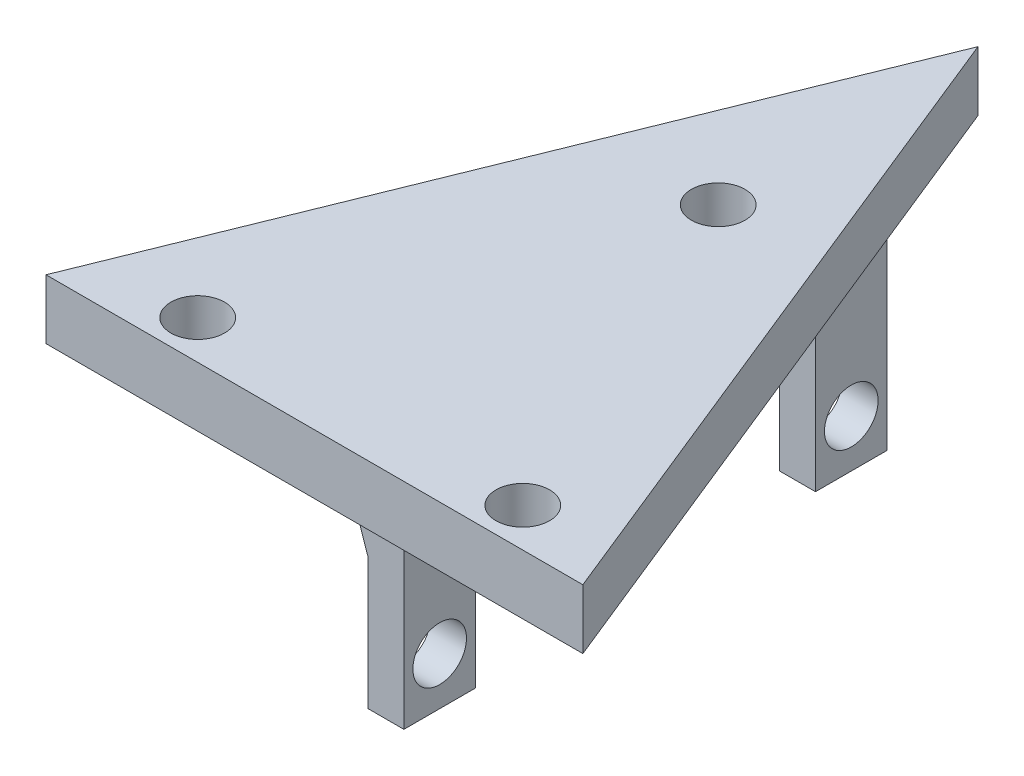
ISO-10303-21;
HEADER;
FILE_DESCRIPTION(('STEP AP214'),'2;1');
FILE_NAME('part.step','',(''),(''),'','','');
FILE_SCHEMA(('AUTOMOTIVE_DESIGN { 1 0 10303 214 1 1 1 1 }'));
ENDSEC;
DATA;
#1=APPLICATION_CONTEXT('core data for automotive mechanical design processes');
#2=APPLICATION_PROTOCOL_DEFINITION('international standard','automotive_design',2000,#1);
#3=PRODUCT_CONTEXT('',#1,'mechanical');
#4=PRODUCT('Part','Part','',(#3));
#5=PRODUCT_RELATED_PRODUCT_CATEGORY('part','',(#4));
#6=PRODUCT_DEFINITION_FORMATION('','',#4);
#7=PRODUCT_DEFINITION_CONTEXT('part definition',#1,'design');
#8=PRODUCT_DEFINITION('design','',#6,#7);
#9=PRODUCT_DEFINITION_SHAPE('','',#8);
#10=(LENGTH_UNIT() NAMED_UNIT(*) SI_UNIT(.MILLI.,.METRE.));
#11=(NAMED_UNIT(*) PLANE_ANGLE_UNIT() SI_UNIT($,.RADIAN.));
#12=(NAMED_UNIT(*) SI_UNIT($,.STERADIAN.) SOLID_ANGLE_UNIT());
#13=UNCERTAINTY_MEASURE_WITH_UNIT(LENGTH_MEASURE(1.E-05),#10,'distance_accuracy_value','');
#14=(GEOMETRIC_REPRESENTATION_CONTEXT(3) GLOBAL_UNCERTAINTY_ASSIGNED_CONTEXT((#13)) GLOBAL_UNIT_ASSIGNED_CONTEXT((#10,
#11,#12)) REPRESENTATION_CONTEXT('',''));
#15=CARTESIAN_POINT('',(0.,0.,0.));
#16=DIRECTION('',(0.,0.,1.));
#17=DIRECTION('',(1.,0.,0.));
#18=AXIS2_PLACEMENT_3D('',#15,#16,#17);
#19=CARTESIAN_POINT('',(0.,0.,0.));
#20=DIRECTION('',(0.,1.,0.));
#21=DIRECTION('',(0.,0.,1.));
#22=AXIS2_PLACEMENT_3D('',#19,#20,#21);
#23=PLANE('',#22);
#24=DIRECTION('',(0.,0.,1.));
#25=VECTOR('',#24,1.);
#26=CARTESIAN_POINT('',(10.6610233893439,0.,-11.));
#27=LINE('',#26,#25);
#28=CARTESIAN_POINT('',(10.6610233893439,0.,-11.));
#29=VERTEX_POINT('',#28);
#30=CARTESIAN_POINT('',(10.6610233893439,0.,-5.));
#31=VERTEX_POINT('',#30);
#32=EDGE_CURVE('E351',#29,#31,#27,.T.);
#33=ORIENTED_EDGE('',*,*,#32,.F.);
#34=DIRECTION('',(1.,0.,0.));
#35=VECTOR('',#34,1.);
#36=CARTESIAN_POINT('',(7.66102338934391,0.,-11.));
#37=LINE('',#36,#35);
#38=CARTESIAN_POINT('',(5.25483661086357,0.,-11.));
#39=VERTEX_POINT('',#38);
#40=EDGE_CURVE('E47',#39,#29,#37,.T.);
#41=ORIENTED_EDGE('',*,*,#40,.F.);
#42=DIRECTION('',(0.,0.,1.));
#43=VECTOR('',#42,1.);
#44=CARTESIAN_POINT('',(5.25483661086357,0.,0.));
#45=LINE('',#44,#43);
#46=CARTESIAN_POINT('',(5.25483661086357,0.,-5.));
#47=VERTEX_POINT('',#46);
#48=EDGE_CURVE('E334',#39,#47,#45,.T.);
#49=ORIENTED_EDGE('',*,*,#48,.T.);
#50=DIRECTION('',(-1.,0.,0.));
#51=VECTOR('',#50,1.);
#52=CARTESIAN_POINT('',(7.66102338934391,0.,-5.));
#53=LINE('',#52,#51);
#54=EDGE_CURVE('E55',#31,#47,#53,.T.);
#55=ORIENTED_EDGE('',*,*,#54,.F.);
#56=EDGE_LOOP('',(#33,#41,#49,#55));
#57=FACE_BOUND('',#56,.T.);
#58=CARTESIAN_POINT('',(22.3778038791205,0.,-3.25));
#59=DIRECTION('',(0.,-1.,0.));
#60=DIRECTION('',(0.,0.,-1.));
#61=AXIS2_PLACEMENT_3D('',#58,#59,#60);
#62=CIRCLE('',#61,2.24789999999999);
#63=CARTESIAN_POINT('',(22.3778038791205,0.,-5.49789999999999));
#64=VERTEX_POINT('',#63);
#65=EDGE_CURVE('E183',#64,#64,#62,.T.);
#66=ORIENTED_EDGE('',*,*,#65,.F.);
#67=EDGE_LOOP('',(#66));
#68=FACE_BOUND('',#67,.T.);
#69=DIRECTION('',(0.,0.,1.));
#70=VECTOR('',#69,1.);
#71=CARTESIAN_POINT('',(10.6610233893439,0.,-45.5));
#72=LINE('',#71,#70);
#73=CARTESIAN_POINT('',(10.6610233893439,0.,-45.5));
#74=VERTEX_POINT('',#73);
#75=CARTESIAN_POINT('',(10.6610233893439,0.,-39.5));
#76=VERTEX_POINT('',#75);
#77=EDGE_CURVE('E155',#74,#76,#72,.T.);
#78=ORIENTED_EDGE('',*,*,#77,.F.);
#79=DIRECTION('',(1.,0.,0.));
#80=VECTOR('',#79,1.);
#81=CARTESIAN_POINT('',(7.66102338934392,0.,-45.5));
#82=LINE('',#81,#80);
#83=CARTESIAN_POINT('',(5.16102338934392,0.,-45.5));
#84=VERTEX_POINT('',#83);
#85=EDGE_CURVE('E152',#84,#74,#82,.T.);
#86=ORIENTED_EDGE('',*,*,#85,.F.);
#87=DIRECTION('',(0.,0.,1.));
#88=VECTOR('',#87,1.);
#89=CARTESIAN_POINT('',(5.16102338934392,0.,0.));
#90=LINE('',#89,#88);
#91=CARTESIAN_POINT('',(5.16102338934392,0.,-39.5));
#92=VERTEX_POINT('',#91);
#93=EDGE_CURVE('E344',#84,#92,#90,.T.);
#94=ORIENTED_EDGE('',*,*,#93,.T.);
#95=DIRECTION('',(-1.,0.,0.));
#96=VECTOR('',#95,1.);
#97=CARTESIAN_POINT('',(7.66102338934392,0.,-39.5));
#98=LINE('',#97,#96);
#99=EDGE_CURVE('E165',#76,#92,#98,.T.);
#100=ORIENTED_EDGE('',*,*,#99,.F.);
#101=EDGE_LOOP('',(#78,#86,#94,#100));
#102=FACE_BOUND('',#101,.T.);
#103=CARTESIAN_POINT('',(-4.87219612087947,0.,-3.25));
#104=DIRECTION('',(0.,-1.,0.));
#105=DIRECTION('',(0.,0.,-1.));
#106=AXIS2_PLACEMENT_3D('',#103,#104,#105);
#107=CIRCLE('',#106,2.24789999999999);
#108=CARTESIAN_POINT('',(-4.87219612087947,0.,-5.49789999999999));
#109=VERTEX_POINT('',#108);
#110=EDGE_CURVE('E189',#109,#109,#107,.T.);
#111=ORIENTED_EDGE('',*,*,#110,.F.);
#112=EDGE_LOOP('',(#111));
#113=FACE_BOUND('',#112,.T.);
#114=CARTESIAN_POINT('',(8.75280387912053,0.,-33.251031232276));
#115=DIRECTION('',(0.,-1.,0.));
#116=DIRECTION('',(0.,0.,-1.));
#117=AXIS2_PLACEMENT_3D('',#114,#115,#116);
#118=CIRCLE('',#117,2.24789999999999);
#119=CARTESIAN_POINT('',(8.75280387912053,0.,-35.498931232276));
#120=VERTEX_POINT('',#119);
#121=EDGE_CURVE('E195',#120,#120,#118,.T.);
#122=ORIENTED_EDGE('',*,*,#121,.F.);
#123=EDGE_LOOP('',(#122));
#124=FACE_BOUND('',#123,.T.);
#125=DIRECTION('',(-0.375,0.,0.927024810886958));
#126=VECTOR('',#125,1.);
#127=CARTESIAN_POINT('',(8.16102338934392,0.,-55.6214886532175));
#128=LINE('',#127,#126);
#129=CARTESIAN_POINT('',(8.16102338934392,0.,-55.6214886532175));
#130=VERTEX_POINT('',#129);
#131=CARTESIAN_POINT('',(-14.3389766106561,0.,0.));
#132=VERTEX_POINT('',#131);
#133=EDGE_CURVE('E201',#130,#132,#128,.T.);
#134=ORIENTED_EDGE('',*,*,#133,.F.);
#135=DIRECTION('',(-0.375,0.,-0.927024810886958));
#136=VECTOR('',#135,1.);
#137=CARTESIAN_POINT('',(30.6610233893439,0.,0.));
#138=LINE('',#137,#136);
#139=CARTESIAN_POINT('',(30.6610233893439,0.,0.));
#140=VERTEX_POINT('',#139);
#141=EDGE_CURVE('E205',#140,#130,#138,.T.);
#142=ORIENTED_EDGE('',*,*,#141,.F.);
#143=DIRECTION('',(1.,0.,0.));
#144=VECTOR('',#143,1.);
#145=CARTESIAN_POINT('',(-14.3389766106561,0.,0.));
#146=LINE('',#145,#144);
#147=EDGE_CURVE('E212',#132,#140,#146,.T.);
#148=ORIENTED_EDGE('',*,*,#147,.F.);
#149=EDGE_LOOP('',(#134,#142,#148));
#150=FACE_BOUND('',#149,.T.);
#151=ADVANCED_FACE('F32',(#57,#68,#102,#113,#124,#150),#23,.F.);
#152=CARTESIAN_POINT('',(8.16102338934392,5.,-55.6214886532175));
#153=DIRECTION('',(0.927024810886958,0.,0.375));
#154=DIRECTION('',(0.375,0.,-0.927024810886958));
#155=AXIS2_PLACEMENT_3D('',#152,#153,#154);
#156=PLANE('',#155);
#157=DIRECTION('',(0.,-1.,0.));
#158=VECTOR('',#157,1.);
#159=CARTESIAN_POINT('',(-14.3389766106561,5.,0.));
#160=LINE('',#159,#158);
#161=CARTESIAN_POINT('',(-14.3389766106561,5.,0.));
#162=VERTEX_POINT('',#161);
#163=EDGE_CURVE('E11',#162,#132,#160,.T.);
#164=ORIENTED_EDGE('',*,*,#163,.F.);
#165=DIRECTION('',(-0.375,0.,0.927024810886958));
#166=VECTOR('',#165,1.);
#167=CARTESIAN_POINT('',(8.16102338934392,5.,-55.6214886532175));
#168=LINE('',#167,#166);
#169=CARTESIAN_POINT('',(8.16102338934392,5.,-55.6214886532175));
#170=VERTEX_POINT('',#169);
#171=EDGE_CURVE('E202',#170,#162,#168,.T.);
#172=ORIENTED_EDGE('',*,*,#171,.F.);
#173=DIRECTION('',(0.,-1.,0.));
#174=VECTOR('',#173,1.);
#175=CARTESIAN_POINT('',(8.16102338934392,5.,-55.6214886532175));
#176=LINE('',#175,#174);
#177=EDGE_CURVE('E209',#170,#130,#176,.T.);
#178=ORIENTED_EDGE('',*,*,#177,.T.);
#179=ORIENTED_EDGE('',*,*,#133,.T.);
#180=EDGE_LOOP('',(#164,#172,#178,#179));
#181=FACE_BOUND('',#180,.T.);
#182=ADVANCED_FACE('F34',(#181),#156,.F.);
#183=CARTESIAN_POINT('',(-14.3389766106561,5.,0.));
#184=DIRECTION('',(0.,0.,-1.));
#185=DIRECTION('',(-1.,0.,0.));
#186=AXIS2_PLACEMENT_3D('',#183,#184,#185);
#187=PLANE('',#186);
#188=ORIENTED_EDGE('',*,*,#147,.T.);
#189=DIRECTION('',(0.,-1.,0.));
#190=VECTOR('',#189,1.);
#191=CARTESIAN_POINT('',(30.6610233893439,5.,0.));
#192=LINE('',#191,#190);
#193=CARTESIAN_POINT('',(30.6610233893439,5.,0.));
#194=VERTEX_POINT('',#193);
#195=EDGE_CURVE('E40',#194,#140,#192,.T.);
#196=ORIENTED_EDGE('',*,*,#195,.F.);
#197=DIRECTION('',(1.,0.,0.));
#198=VECTOR('',#197,1.);
#199=CARTESIAN_POINT('',(-14.3389766106561,5.,0.));
#200=LINE('',#199,#198);
#201=EDGE_CURVE('E204',#162,#194,#200,.T.);
#202=ORIENTED_EDGE('',*,*,#201,.F.);
#203=ORIENTED_EDGE('',*,*,#163,.T.);
#204=EDGE_LOOP('',(#188,#196,#202,#203));
#205=FACE_BOUND('',#204,.T.);
#206=ADVANCED_FACE('F233',(#205),#187,.F.);
#207=CARTESIAN_POINT('',(30.6610233893439,5.,0.));
#208=DIRECTION('',(-0.927024810886958,0.,0.375));
#209=DIRECTION('',(0.375,0.,0.927024810886958));
#210=AXIS2_PLACEMENT_3D('',#207,#208,#209);
#211=PLANE('',#210);
#212=ORIENTED_EDGE('',*,*,#177,.F.);
#213=DIRECTION('',(-0.375,0.,-0.927024810886958));
#214=VECTOR('',#213,1.);
#215=CARTESIAN_POINT('',(30.6610233893439,5.,0.));
#216=LINE('',#215,#214);
#217=EDGE_CURVE('E207',#194,#170,#216,.T.);
#218=ORIENTED_EDGE('',*,*,#217,.F.);
#219=ORIENTED_EDGE('',*,*,#195,.T.);
#220=ORIENTED_EDGE('',*,*,#141,.T.);
#221=EDGE_LOOP('',(#212,#218,#219,#220));
#222=FACE_BOUND('',#221,.T.);
#223=ADVANCED_FACE('F222',(#222),#211,.F.);
#224=CARTESIAN_POINT('',(0.,5.,0.));
#225=DIRECTION('',(0.,1.,0.));
#226=DIRECTION('',(0.,0.,1.));
#227=AXIS2_PLACEMENT_3D('',#224,#225,#226);
#228=PLANE('',#227);
#229=CARTESIAN_POINT('',(22.3778038791205,5.,-3.25));
#230=DIRECTION('',(0.,1.,0.));
#231=DIRECTION('',(0.,0.,1.));
#232=AXIS2_PLACEMENT_3D('',#229,#230,#231);
#233=CIRCLE('',#232,2.24789999999999);
#234=CARTESIAN_POINT('',(22.3778038791205,5.,-1.00210000000001));
#235=VERTEX_POINT('',#234);
#236=EDGE_CURVE('E186',#235,#235,#233,.T.);
#237=ORIENTED_EDGE('',*,*,#236,.F.);
#238=EDGE_LOOP('',(#237));
#239=FACE_BOUND('',#238,.T.);
#240=ORIENTED_EDGE('',*,*,#217,.T.);
#241=ORIENTED_EDGE('',*,*,#171,.T.);
#242=ORIENTED_EDGE('',*,*,#201,.T.);
#243=EDGE_LOOP('',(#240,#241,#242));
#244=FACE_BOUND('',#243,.T.);
#245=CARTESIAN_POINT('',(-4.87219612087947,5.,-3.25));
#246=DIRECTION('',(0.,1.,0.));
#247=DIRECTION('',(0.,0.,1.));
#248=AXIS2_PLACEMENT_3D('',#245,#246,#247);
#249=CIRCLE('',#248,2.24789999999999);
#250=CARTESIAN_POINT('',(-4.87219612087947,5.,-1.00210000000001));
#251=VERTEX_POINT('',#250);
#252=EDGE_CURVE('E192',#251,#251,#249,.T.);
#253=ORIENTED_EDGE('',*,*,#252,.F.);
#254=EDGE_LOOP('',(#253));
#255=FACE_BOUND('',#254,.T.);
#256=CARTESIAN_POINT('',(8.75280387912053,5.,-33.251031232276));
#257=DIRECTION('',(0.,1.,0.));
#258=DIRECTION('',(0.,0.,1.));
#259=AXIS2_PLACEMENT_3D('',#256,#257,#258);
#260=CIRCLE('',#259,2.24789999999999);
#261=CARTESIAN_POINT('',(8.75280387912053,5.,-31.003131232276));
#262=VERTEX_POINT('',#261);
#263=EDGE_CURVE('E198',#262,#262,#260,.T.);
#264=ORIENTED_EDGE('',*,*,#263,.F.);
#265=EDGE_LOOP('',(#264));
#266=FACE_BOUND('',#265,.T.);
#267=ADVANCED_FACE('F231',(#239,#244,#255,#266),#228,.T.);
#268=CARTESIAN_POINT('',(8.75280387912053,0.,-33.251031232276));
#269=DIRECTION('',(0.,-1.,0.));
#270=DIRECTION('',(0.,0.,-1.));
#271=AXIS2_PLACEMENT_3D('',#268,#269,#270);
#272=CYLINDRICAL_SURFACE('',#271,2.24789999999999);
#273=ORIENTED_EDGE('',*,*,#263,.T.);
#274=EDGE_LOOP('',(#273));
#275=FACE_BOUND('',#274,.T.);
#276=ORIENTED_EDGE('',*,*,#121,.T.);
#277=EDGE_LOOP('',(#276));
#278=FACE_BOUND('',#277,.T.);
#279=ADVANCED_FACE('F248',(#275,#278),#272,.F.);
#280=CARTESIAN_POINT('',(-4.87219612087947,0.,-3.25));
#281=DIRECTION('',(0.,-1.,0.));
#282=DIRECTION('',(0.,0.,-1.));
#283=AXIS2_PLACEMENT_3D('',#280,#281,#282);
#284=CYLINDRICAL_SURFACE('',#283,2.24789999999999);
#285=ORIENTED_EDGE('',*,*,#252,.T.);
#286=EDGE_LOOP('',(#285));
#287=FACE_BOUND('',#286,.T.);
#288=ORIENTED_EDGE('',*,*,#110,.T.);
#289=EDGE_LOOP('',(#288));
#290=FACE_BOUND('',#289,.T.);
#291=ADVANCED_FACE('F252',(#287,#290),#284,.F.);
#292=CARTESIAN_POINT('',(22.3778038791205,0.,-3.25));
#293=DIRECTION('',(0.,-1.,0.));
#294=DIRECTION('',(0.,0.,-1.));
#295=AXIS2_PLACEMENT_3D('',#292,#293,#294);
#296=CYLINDRICAL_SURFACE('',#295,2.24789999999999);
#297=ORIENTED_EDGE('',*,*,#236,.T.);
#298=EDGE_LOOP('',(#297));
#299=FACE_BOUND('',#298,.T.);
#300=ORIENTED_EDGE('',*,*,#65,.T.);
#301=EDGE_LOOP('',(#300));
#302=FACE_BOUND('',#301,.T.);
#303=ADVANCED_FACE('F256',(#299,#302),#296,.F.);
#304=CARTESIAN_POINT('',(7.66102338934392,-18.,-45.5));
#305=DIRECTION('',(1.,0.,0.));
#306=DIRECTION('',(0.,0.,-1.));
#307=AXIS2_PLACEMENT_3D('',#304,#305,#306);
#308=PLANE('',#307);
#309=CARTESIAN_POINT('',(7.66102338934393,-14.,-42.5));
#310=DIRECTION('',(-1.,0.,0.));
#311=DIRECTION('',(0.,0.,1.));
#312=AXIS2_PLACEMENT_3D('',#309,#310,#311);
#313=CIRCLE('',#312,2.24789999999999);
#314=CARTESIAN_POINT('',(7.66102338934393,-14.,-40.2521));
#315=VERTEX_POINT('',#314);
#316=EDGE_CURVE('E315',#315,#315,#313,.T.);
#317=ORIENTED_EDGE('',*,*,#316,.F.);
#318=EDGE_LOOP('',(#317));
#319=FACE_BOUND('',#318,.T.);
#320=DIRECTION('',(0.,1.,0.));
#321=VECTOR('',#320,1.);
#322=CARTESIAN_POINT('',(7.66102338934392,-18.,-39.5));
#323=LINE('',#322,#321);
#324=CARTESIAN_POINT('',(7.66102338934392,-18.,-39.5));
#325=VERTEX_POINT('',#324);
#326=CARTESIAN_POINT('',(7.66102338934392,-6.99999999999998,-39.5));
#327=VERTEX_POINT('',#326);
#328=EDGE_CURVE('E170',#325,#327,#323,.T.);
#329=ORIENTED_EDGE('',*,*,#328,.T.);
#330=DIRECTION('',(0.,0.,-1.));
#331=VECTOR('',#330,1.);
#332=CARTESIAN_POINT('',(7.66102338934392,-7.,-45.5));
#333=LINE('',#332,#331);
#334=CARTESIAN_POINT('',(7.66102338934392,-6.99999999999998,-45.5));
#335=VERTEX_POINT('',#334);
#336=EDGE_CURVE('E340',#327,#335,#333,.T.);
#337=ORIENTED_EDGE('',*,*,#336,.T.);
#338=DIRECTION('',(0.,1.,0.));
#339=VECTOR('',#338,1.);
#340=CARTESIAN_POINT('',(7.66102338934392,-18.,-45.5));
#341=LINE('',#340,#339);
#342=CARTESIAN_POINT('',(7.66102338934392,-18.,-45.5));
#343=VERTEX_POINT('',#342);
#344=EDGE_CURVE('E180',#343,#335,#341,.T.);
#345=ORIENTED_EDGE('',*,*,#344,.F.);
#346=DIRECTION('',(0.,0.,-1.));
#347=VECTOR('',#346,1.);
#348=CARTESIAN_POINT('',(7.66102338934392,-18.,-45.5));
#349=LINE('',#348,#347);
#350=EDGE_CURVE('E161',#325,#343,#349,.T.);
#351=ORIENTED_EDGE('',*,*,#350,.F.);
#352=EDGE_LOOP('',(#329,#337,#345,#351));
#353=FACE_BOUND('',#352,.T.);
#354=ADVANCED_FACE('F260',(#319,#353),#308,.F.);
#355=CARTESIAN_POINT('',(7.66102338934392,-18.,-45.5));
#356=DIRECTION('',(0.,0.,1.));
#357=DIRECTION('',(1.,0.,0.));
#358=AXIS2_PLACEMENT_3D('',#355,#356,#357);
#359=PLANE('',#358);
#360=ORIENTED_EDGE('',*,*,#344,.T.);
#361=DIRECTION('',(-0.336336396998156,0.941741911594837,0.));
#362=VECTOR('',#361,1.);
#363=CARTESIAN_POINT('',(7.66102338934392,-7.,-45.5));
#364=LINE('',#363,#362);
#365=EDGE_CURVE('E337',#335,#84,#364,.T.);
#366=ORIENTED_EDGE('',*,*,#365,.T.);
#367=ORIENTED_EDGE('',*,*,#85,.T.);
#368=DIRECTION('',(0.,1.,0.));
#369=VECTOR('',#368,1.);
#370=CARTESIAN_POINT('',(10.6610233893439,-18.,-45.5));
#371=LINE('',#370,#369);
#372=CARTESIAN_POINT('',(10.6610233893439,-18.,-45.5));
#373=VERTEX_POINT('',#372);
#374=EDGE_CURVE('E178',#373,#74,#371,.T.);
#375=ORIENTED_EDGE('',*,*,#374,.F.);
#376=DIRECTION('',(1.,0.,0.));
#377=VECTOR('',#376,1.);
#378=CARTESIAN_POINT('',(7.66102338934392,-18.,-45.5));
#379=LINE('',#378,#377);
#380=EDGE_CURVE('E164',#343,#373,#379,.T.);
#381=ORIENTED_EDGE('',*,*,#380,.F.);
#382=EDGE_LOOP('',(#360,#366,#367,#375,#381));
#383=FACE_BOUND('',#382,.T.);
#384=ADVANCED_FACE('F264',(#383),#359,.F.);
#385=CARTESIAN_POINT('',(10.6610233893439,-18.,-45.5));
#386=DIRECTION('',(-1.,0.,0.));
#387=DIRECTION('',(0.,0.,1.));
#388=AXIS2_PLACEMENT_3D('',#385,#386,#387);
#389=PLANE('',#388);
#390=CARTESIAN_POINT('',(10.6610233893439,-14.,-42.5));
#391=DIRECTION('',(-1.,0.,0.));
#392=DIRECTION('',(0.,0.,1.));
#393=AXIS2_PLACEMENT_3D('',#390,#391,#392);
#394=CIRCLE('',#393,2.24789999999999);
#395=CARTESIAN_POINT('',(10.6610233893439,-14.,-40.2521));
#396=VERTEX_POINT('',#395);
#397=EDGE_CURVE('E318',#396,#396,#394,.T.);
#398=ORIENTED_EDGE('',*,*,#397,.T.);
#399=EDGE_LOOP('',(#398));
#400=FACE_BOUND('',#399,.T.);
#401=ORIENTED_EDGE('',*,*,#374,.T.);
#402=ORIENTED_EDGE('',*,*,#77,.T.);
#403=DIRECTION('',(0.,1.,0.));
#404=VECTOR('',#403,1.);
#405=CARTESIAN_POINT('',(10.6610233893439,-18.,-39.5));
#406=LINE('',#405,#404);
#407=CARTESIAN_POINT('',(10.6610233893439,-18.,-39.5));
#408=VERTEX_POINT('',#407);
#409=EDGE_CURVE('E176',#408,#76,#406,.T.);
#410=ORIENTED_EDGE('',*,*,#409,.F.);
#411=DIRECTION('',(0.,0.,1.));
#412=VECTOR('',#411,1.);
#413=CARTESIAN_POINT('',(10.6610233893439,-18.,-45.5));
#414=LINE('',#413,#412);
#415=EDGE_CURVE('E167',#373,#408,#414,.T.);
#416=ORIENTED_EDGE('',*,*,#415,.F.);
#417=EDGE_LOOP('',(#401,#402,#410,#416));
#418=FACE_BOUND('',#417,.T.);
#419=ADVANCED_FACE('F268',(#400,#418),#389,.F.);
#420=CARTESIAN_POINT('',(7.66102338934392,-18.,-39.5));
#421=DIRECTION('',(0.,0.,-1.));
#422=DIRECTION('',(-1.,0.,0.));
#423=AXIS2_PLACEMENT_3D('',#420,#421,#422);
#424=PLANE('',#423);
#425=ORIENTED_EDGE('',*,*,#409,.T.);
#426=ORIENTED_EDGE('',*,*,#99,.T.);
#427=DIRECTION('',(-0.336336396998156,0.941741911594837,0.));
#428=VECTOR('',#427,1.);
#429=CARTESIAN_POINT('',(7.66102338934392,-7.,-39.5));
#430=LINE('',#429,#428);
#431=EDGE_CURVE('E336',#327,#92,#430,.T.);
#432=ORIENTED_EDGE('',*,*,#431,.F.);
#433=ORIENTED_EDGE('',*,*,#328,.F.);
#434=DIRECTION('',(-1.,0.,0.));
#435=VECTOR('',#434,1.);
#436=CARTESIAN_POINT('',(7.66102338934392,-18.,-39.5));
#437=LINE('',#436,#435);
#438=EDGE_CURVE('E169',#408,#325,#437,.T.);
#439=ORIENTED_EDGE('',*,*,#438,.F.);
#440=EDGE_LOOP('',(#425,#426,#432,#433,#439));
#441=FACE_BOUND('',#440,.T.);
#442=ADVANCED_FACE('F272',(#441),#424,.F.);
#443=CARTESIAN_POINT('',(0.,-18.,0.));
#444=DIRECTION('',(0.,1.,0.));
#445=DIRECTION('',(0.,0.,1.));
#446=AXIS2_PLACEMENT_3D('',#443,#444,#445);
#447=PLANE('',#446);
#448=ORIENTED_EDGE('',*,*,#350,.T.);
#449=ORIENTED_EDGE('',*,*,#380,.T.);
#450=ORIENTED_EDGE('',*,*,#415,.T.);
#451=ORIENTED_EDGE('',*,*,#438,.T.);
#452=EDGE_LOOP('',(#448,#449,#450,#451));
#453=FACE_BOUND('',#452,.T.);
#454=ADVANCED_FACE('F276',(#453),#447,.F.);
#455=CARTESIAN_POINT('',(7.66102338934391,-18.,-11.));
#456=DIRECTION('',(1.,0.,0.));
#457=DIRECTION('',(0.,0.,-1.));
#458=AXIS2_PLACEMENT_3D('',#455,#456,#457);
#459=PLANE('',#458);
#460=CARTESIAN_POINT('',(7.66102338934391,-14.,-8.));
#461=DIRECTION('',(-1.,0.,0.));
#462=DIRECTION('',(0.,0.,1.));
#463=AXIS2_PLACEMENT_3D('',#460,#461,#462);
#464=CIRCLE('',#463,2.24789999999999);
#465=CARTESIAN_POINT('',(7.66102338934391,-14.,-5.75210000000002));
#466=VERTEX_POINT('',#465);
#467=EDGE_CURVE('E319',#466,#466,#464,.T.);
#468=ORIENTED_EDGE('',*,*,#467,.F.);
#469=EDGE_LOOP('',(#468));
#470=FACE_BOUND('',#469,.T.);
#471=DIRECTION('',(0.,1.,0.));
#472=VECTOR('',#471,1.);
#473=CARTESIAN_POINT('',(7.66102338934391,-18.,-5.));
#474=LINE('',#473,#472);
#475=CARTESIAN_POINT('',(7.66102338934391,-18.,-5.));
#476=VERTEX_POINT('',#475);
#477=CARTESIAN_POINT('',(7.66102338934391,-6.99999999999999,-5.));
#478=VERTEX_POINT('',#477);
#479=EDGE_CURVE('E349',#476,#478,#474,.T.);
#480=ORIENTED_EDGE('',*,*,#479,.T.);
#481=DIRECTION('',(0.,0.,-1.));
#482=VECTOR('',#481,1.);
#483=CARTESIAN_POINT('',(7.66102338934391,-7.,-11.));
#484=LINE('',#483,#482);
#485=CARTESIAN_POINT('',(7.66102338934391,-6.99999999999999,-11.));
#486=VERTEX_POINT('',#485);
#487=EDGE_CURVE('E151',#478,#486,#484,.T.);
#488=ORIENTED_EDGE('',*,*,#487,.T.);
#489=DIRECTION('',(0.,1.,0.));
#490=VECTOR('',#489,1.);
#491=CARTESIAN_POINT('',(7.66102338934391,-18.,-11.));
#492=LINE('',#491,#490);
#493=CARTESIAN_POINT('',(7.66102338934391,-18.,-11.));
#494=VERTEX_POINT('',#493);
#495=EDGE_CURVE('E134',#494,#486,#492,.T.);
#496=ORIENTED_EDGE('',*,*,#495,.F.);
#497=DIRECTION('',(0.,0.,-1.));
#498=VECTOR('',#497,1.);
#499=CARTESIAN_POINT('',(7.66102338934391,-18.,-11.));
#500=LINE('',#499,#498);
#501=EDGE_CURVE('E140',#476,#494,#500,.T.);
#502=ORIENTED_EDGE('',*,*,#501,.F.);
#503=EDGE_LOOP('',(#480,#488,#496,#502));
#504=FACE_BOUND('',#503,.T.);
#505=ADVANCED_FACE('F149',(#470,#504),#459,.F.);
#506=CARTESIAN_POINT('',(7.66102338934391,-18.,-11.));
#507=DIRECTION('',(0.,0.,1.));
#508=DIRECTION('',(1.,0.,0.));
#509=AXIS2_PLACEMENT_3D('',#506,#507,#508);
#510=PLANE('',#509);
#511=ORIENTED_EDGE('',*,*,#495,.T.);
#512=DIRECTION('',(-0.325072129970217,0.945689225018783,0.));
#513=VECTOR('',#512,1.);
#514=CARTESIAN_POINT('',(7.66102338934391,-7.,-11.));
#515=LINE('',#514,#513);
#516=EDGE_CURVE('E329',#486,#39,#515,.T.);
#517=ORIENTED_EDGE('',*,*,#516,.T.);
#518=ORIENTED_EDGE('',*,*,#40,.T.);
#519=DIRECTION('',(0.,1.,0.));
#520=VECTOR('',#519,1.);
#521=CARTESIAN_POINT('',(10.6610233893439,-18.,-11.));
#522=LINE('',#521,#520);
#523=CARTESIAN_POINT('',(10.6610233893439,-18.,-11.));
#524=VERTEX_POINT('',#523);
#525=EDGE_CURVE('E136',#524,#29,#522,.T.);
#526=ORIENTED_EDGE('',*,*,#525,.F.);
#527=DIRECTION('',(1.,0.,0.));
#528=VECTOR('',#527,1.);
#529=CARTESIAN_POINT('',(7.66102338934391,-18.,-11.));
#530=LINE('',#529,#528);
#531=EDGE_CURVE('E129',#494,#524,#530,.T.);
#532=ORIENTED_EDGE('',*,*,#531,.F.);
#533=EDGE_LOOP('',(#511,#517,#518,#526,#532));
#534=FACE_BOUND('',#533,.T.);
#535=ADVANCED_FACE('F131',(#534),#510,.F.);
#536=CARTESIAN_POINT('',(10.6610233893439,-18.,-11.));
#537=DIRECTION('',(-1.,0.,0.));
#538=DIRECTION('',(0.,0.,1.));
#539=AXIS2_PLACEMENT_3D('',#536,#537,#538);
#540=PLANE('',#539);
#541=CARTESIAN_POINT('',(10.6610233893439,-14.,-8.));
#542=DIRECTION('',(-1.,0.,0.));
#543=DIRECTION('',(0.,0.,1.));
#544=AXIS2_PLACEMENT_3D('',#541,#542,#543);
#545=CIRCLE('',#544,2.24789999999999);
#546=CARTESIAN_POINT('',(10.6610233893439,-14.,-5.75210000000002));
#547=VERTEX_POINT('',#546);
#548=EDGE_CURVE('E322',#547,#547,#545,.T.);
#549=ORIENTED_EDGE('',*,*,#548,.T.);
#550=EDGE_LOOP('',(#549));
#551=FACE_BOUND('',#550,.T.);
#552=ORIENTED_EDGE('',*,*,#525,.T.);
#553=ORIENTED_EDGE('',*,*,#32,.T.);
#554=DIRECTION('',(0.,1.,0.));
#555=VECTOR('',#554,1.);
#556=CARTESIAN_POINT('',(10.6610233893439,-18.,-5.));
#557=LINE('',#556,#555);
#558=CARTESIAN_POINT('',(10.6610233893439,-18.,-5.));
#559=VERTEX_POINT('',#558);
#560=EDGE_CURVE('E157',#559,#31,#557,.T.);
#561=ORIENTED_EDGE('',*,*,#560,.F.);
#562=DIRECTION('',(0.,0.,1.));
#563=VECTOR('',#562,1.);
#564=CARTESIAN_POINT('',(10.6610233893439,-18.,-11.));
#565=LINE('',#564,#563);
#566=EDGE_CURVE('E139',#524,#559,#565,.T.);
#567=ORIENTED_EDGE('',*,*,#566,.F.);
#568=EDGE_LOOP('',(#552,#553,#561,#567));
#569=FACE_BOUND('',#568,.T.);
#570=ADVANCED_FACE('F286',(#551,#569),#540,.F.);
#571=CARTESIAN_POINT('',(7.66102338934391,-18.,-5.));
#572=DIRECTION('',(0.,0.,-1.));
#573=DIRECTION('',(-1.,0.,0.));
#574=AXIS2_PLACEMENT_3D('',#571,#572,#573);
#575=PLANE('',#574);
#576=ORIENTED_EDGE('',*,*,#560,.T.);
#577=ORIENTED_EDGE('',*,*,#54,.T.);
#578=DIRECTION('',(-0.325072129970217,0.945689225018783,0.));
#579=VECTOR('',#578,1.);
#580=CARTESIAN_POINT('',(7.66102338934391,-7.,-5.));
#581=LINE('',#580,#579);
#582=EDGE_CURVE('E328',#478,#47,#581,.T.);
#583=ORIENTED_EDGE('',*,*,#582,.F.);
#584=ORIENTED_EDGE('',*,*,#479,.F.);
#585=DIRECTION('',(-1.,0.,0.));
#586=VECTOR('',#585,1.);
#587=CARTESIAN_POINT('',(7.66102338934391,-18.,-5.));
#588=LINE('',#587,#586);
#589=EDGE_CURVE('E145',#559,#476,#588,.T.);
#590=ORIENTED_EDGE('',*,*,#589,.F.);
#591=EDGE_LOOP('',(#576,#577,#583,#584,#590));
#592=FACE_BOUND('',#591,.T.);
#593=ADVANCED_FACE('F289',(#592),#575,.F.);
#594=CARTESIAN_POINT('',(0.,-18.,0.));
#595=DIRECTION('',(0.,1.,0.));
#596=DIRECTION('',(0.,0.,1.));
#597=AXIS2_PLACEMENT_3D('',#594,#595,#596);
#598=PLANE('',#597);
#599=ORIENTED_EDGE('',*,*,#501,.T.);
#600=ORIENTED_EDGE('',*,*,#531,.T.);
#601=ORIENTED_EDGE('',*,*,#566,.T.);
#602=ORIENTED_EDGE('',*,*,#589,.T.);
#603=EDGE_LOOP('',(#599,#600,#601,#602));
#604=FACE_BOUND('',#603,.T.);
#605=ADVANCED_FACE('F143',(#604),#598,.F.);
#606=CARTESIAN_POINT('',(7.66102338934392,-7.,-45.5));
#607=DIRECTION('',(-0.941741911594838,-0.336336396998156,0.));
#608=DIRECTION('',(-0.336336396998156,0.941741911594837,0.));
#609=AXIS2_PLACEMENT_3D('',#606,#607,#608);
#610=PLANE('',#609);
#611=ORIENTED_EDGE('',*,*,#93,.F.);
#612=ORIENTED_EDGE('',*,*,#365,.F.);
#613=ORIENTED_EDGE('',*,*,#336,.F.);
#614=ORIENTED_EDGE('',*,*,#431,.T.);
#615=EDGE_LOOP('',(#611,#612,#613,#614));
#616=FACE_BOUND('',#615,.T.);
#617=ADVANCED_FACE('F295',(#616),#610,.T.);
#618=CARTESIAN_POINT('',(7.66102338934391,-7.,-11.));
#619=DIRECTION('',(-0.945689225018783,-0.325072129970217,0.));
#620=DIRECTION('',(-0.325072129970217,0.945689225018783,0.));
#621=AXIS2_PLACEMENT_3D('',#618,#619,#620);
#622=PLANE('',#621);
#623=ORIENTED_EDGE('',*,*,#48,.F.);
#624=ORIENTED_EDGE('',*,*,#516,.F.);
#625=ORIENTED_EDGE('',*,*,#487,.F.);
#626=ORIENTED_EDGE('',*,*,#582,.T.);
#627=EDGE_LOOP('',(#623,#624,#625,#626));
#628=FACE_BOUND('',#627,.T.);
#629=ADVANCED_FACE('F298',(#628),#622,.T.);
#630=CARTESIAN_POINT('',(7.66102338934391,-14.,-8.));
#631=DIRECTION('',(-1.,0.,0.));
#632=DIRECTION('',(0.,0.,1.));
#633=AXIS2_PLACEMENT_3D('',#630,#631,#632);
#634=CYLINDRICAL_SURFACE('',#633,2.24789999999999);
#635=ORIENTED_EDGE('',*,*,#467,.T.);
#636=EDGE_LOOP('',(#635));
#637=FACE_BOUND('',#636,.T.);
#638=ORIENTED_EDGE('',*,*,#548,.F.);
#639=EDGE_LOOP('',(#638));
#640=FACE_BOUND('',#639,.T.);
#641=ADVANCED_FACE('F302',(#637,#640),#634,.F.);
#642=CARTESIAN_POINT('',(7.66102338934393,-14.,-42.5));
#643=DIRECTION('',(-1.,0.,0.));
#644=DIRECTION('',(0.,0.,1.));
#645=AXIS2_PLACEMENT_3D('',#642,#643,#644);
#646=CYLINDRICAL_SURFACE('',#645,2.24789999999999);
#647=ORIENTED_EDGE('',*,*,#316,.T.);
#648=EDGE_LOOP('',(#647));
#649=FACE_BOUND('',#648,.T.);
#650=ORIENTED_EDGE('',*,*,#397,.F.);
#651=EDGE_LOOP('',(#650));
#652=FACE_BOUND('',#651,.T.);
#653=ADVANCED_FACE('F306',(#649,#652),#646,.F.);
#654=CLOSED_SHELL('',(#151,#182,#206,#223,#267,#279,#291,#303,#354,#384,#419,#442,#454,#505,
#535,#570,#593,#605,#617,#629,#641,#653));
#655=MANIFOLD_SOLID_BREP('B2',#654);
#656=ADVANCED_BREP_SHAPE_REPRESENTATION('',(#18,#655),#14);
#657=SHAPE_DEFINITION_REPRESENTATION(#9,#656);
ENDSEC;
END-ISO-10303-21;
